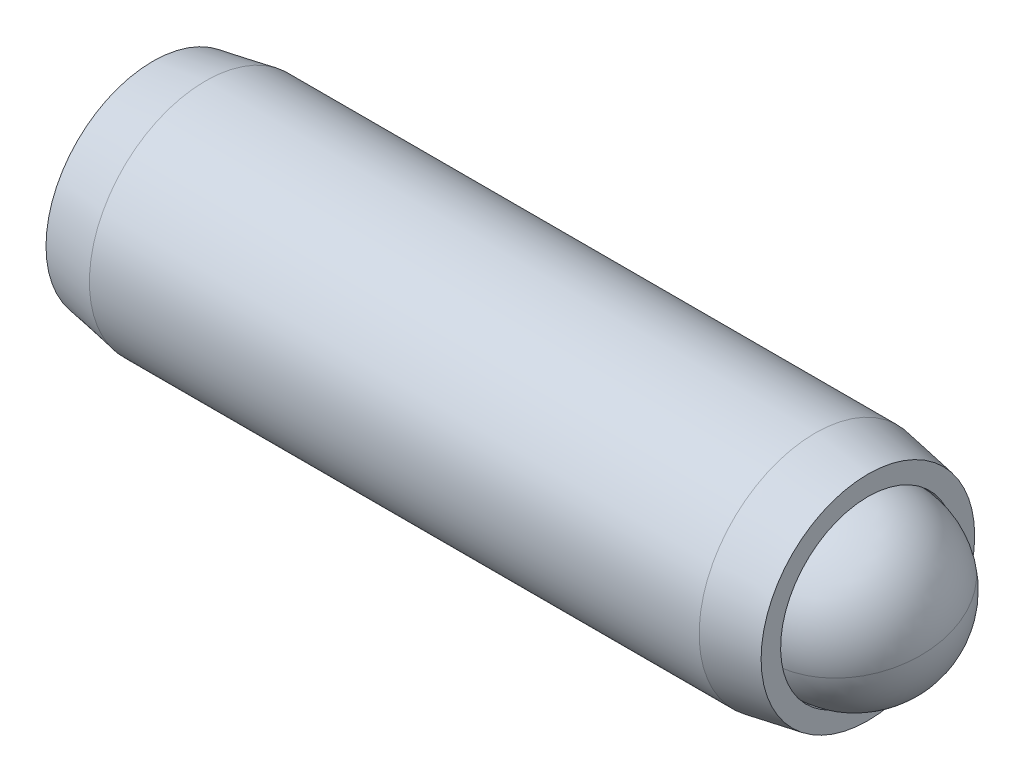
ISO-10303-21;
HEADER;
FILE_DESCRIPTION(('STEP AP214'),'2;1');
FILE_NAME('part.step','',(''),(''),'','','');
FILE_SCHEMA(('AUTOMOTIVE_DESIGN { 1 0 10303 214 1 1 1 1 }'));
ENDSEC;
DATA;
#1=APPLICATION_CONTEXT('core data for automotive mechanical design processes');
#2=APPLICATION_PROTOCOL_DEFINITION('international standard','automotive_design',2000,#1);
#3=PRODUCT_CONTEXT('',#1,'mechanical');
#4=PRODUCT('Part','Part','',(#3));
#5=PRODUCT_RELATED_PRODUCT_CATEGORY('part','',(#4));
#6=PRODUCT_DEFINITION_FORMATION('','',#4);
#7=PRODUCT_DEFINITION_CONTEXT('part definition',#1,'design');
#8=PRODUCT_DEFINITION('design','',#6,#7);
#9=PRODUCT_DEFINITION_SHAPE('','',#8);
#10=(LENGTH_UNIT() NAMED_UNIT(*) SI_UNIT(.MILLI.,.METRE.));
#11=(NAMED_UNIT(*) PLANE_ANGLE_UNIT() SI_UNIT($,.RADIAN.));
#12=(NAMED_UNIT(*) SI_UNIT($,.STERADIAN.) SOLID_ANGLE_UNIT());
#13=UNCERTAINTY_MEASURE_WITH_UNIT(LENGTH_MEASURE(1.E-05),#10,'distance_accuracy_value','');
#14=(GEOMETRIC_REPRESENTATION_CONTEXT(3) GLOBAL_UNCERTAINTY_ASSIGNED_CONTEXT((#13)) GLOBAL_UNIT_ASSIGNED_CONTEXT((#10,
#11,#12)) REPRESENTATION_CONTEXT('',''));
#15=CARTESIAN_POINT('',(0.,0.,0.));
#16=DIRECTION('',(0.,0.,1.));
#17=DIRECTION('',(1.,0.,0.));
#18=AXIS2_PLACEMENT_3D('',#15,#16,#17);
#19=CARTESIAN_POINT('',(-12.4963459470191,2.74204998828509,-0.965131231055238));
#20=DIRECTION('',(-1.,0.,0.));
#21=DIRECTION('',(0.,-1.,0.));
#22=AXIS2_PLACEMENT_3D('',#19,#20,#21);
#23=PLANE('',#22);
#24=DIRECTION('',(0.,0.866025403784439,-0.5));
#25=VECTOR('',#24,1.);
#26=CARTESIAN_POINT('',(-12.4963459470191,2.61504998828509,-2.33078112403965));
#27=LINE('',#26,#25);
#28=CARTESIAN_POINT('',(-12.4963459470191,1.49586248828509,-1.68461791964099));
#29=VERTEX_POINT('',#28);
#30=CARTESIAN_POINT('',(-12.4963459470191,2.74204998828509,-2.40410460822674));
#31=VERTEX_POINT('',#30);
#32=EDGE_CURVE('P0_E164',#29,#31,#27,.T.);
#33=ORIENTED_EDGE('',*,*,#32,.T.);
#34=DIRECTION('',(0.,0.866025403784439,0.5));
#35=VECTOR('',#34,1.);
#36=CARTESIAN_POINT('',(-12.4963459470191,3.86123748828509,-1.75794140382807));
#37=LINE('',#36,#35);
#38=CARTESIAN_POINT('',(-12.4963459470191,3.98823748828509,-1.68461791964099));
#39=VERTEX_POINT('',#38);
#40=EDGE_CURVE('P0_E166',#31,#39,#37,.T.);
#41=ORIENTED_EDGE('',*,*,#40,.T.);
#42=DIRECTION('',(0.,0.,1.));
#43=VECTOR('',#42,1.);
#44=CARTESIAN_POINT('',(-12.4963459470191,3.98823748828509,-0.392291510843657));
#45=LINE('',#44,#43);
#46=CARTESIAN_POINT('',(-12.4963459470191,3.98823748828509,-0.245644542469492));
#47=VERTEX_POINT('',#46);
#48=EDGE_CURVE('P0_E156',#39,#47,#45,.T.);
#49=ORIENTED_EDGE('',*,*,#48,.T.);
#50=DIRECTION('',(0.,-0.866025403784438,0.5));
#51=VECTOR('',#50,1.);
#52=CARTESIAN_POINT('',(-12.4963459470191,2.86904998828509,0.400518661929174));
#53=LINE('',#52,#51);
#54=CARTESIAN_POINT('',(-12.4963459470191,2.74204998828509,0.473842146116257));
#55=VERTEX_POINT('',#54);
#56=EDGE_CURVE('P0_E158',#47,#55,#53,.T.);
#57=ORIENTED_EDGE('',*,*,#56,.T.);
#58=DIRECTION('',(0.,-0.866025403784439,-0.5));
#59=VECTOR('',#58,1.);
#60=CARTESIAN_POINT('',(-12.4963459470191,1.62286248828509,-0.172321058282407));
#61=LINE('',#60,#59);
#62=CARTESIAN_POINT('',(-12.4963459470191,1.49586248828509,-0.24564454246949));
#63=VERTEX_POINT('',#62);
#64=EDGE_CURVE('P0_E160',#55,#63,#61,.T.);
#65=ORIENTED_EDGE('',*,*,#64,.T.);
#66=DIRECTION('',(0.,0.,-1.));
#67=VECTOR('',#66,1.);
#68=CARTESIAN_POINT('',(-12.4963459470191,1.49586248828509,-1.53797095126682));
#69=LINE('',#68,#67);
#70=EDGE_CURVE('P0_E162',#63,#29,#69,.T.);
#71=ORIENTED_EDGE('',*,*,#70,.T.);
#72=EDGE_LOOP('',(#33,#41,#49,#57,#65,#71));
#73=FACE_BOUND('',#72,.T.);
#74=CARTESIAN_POINT('',(-12.4963459470191,2.74204998828509,-0.965131231055238));
#75=DIRECTION('',(1.,0.,0.));
#76=DIRECTION('',(0.,1.,0.));
#77=AXIS2_PLACEMENT_3D('',#74,#75,#76);
#78=CIRCLE('',#77,2.921);
#79=CARTESIAN_POINT('',(-12.4963459470191,5.66304998828509,-0.965131231055238));
#80=VERTEX_POINT('',#79);
#81=EDGE_CURVE('P0_E150',#80,#80,#78,.T.);
#82=ORIENTED_EDGE('',*,*,#81,.F.);
#83=EDGE_LOOP('',(#82));
#84=FACE_BOUND('',#83,.T.);
#85=ADVANCED_FACE('P0_F17',(#73,#84),#23,.T.);
#86=CARTESIAN_POINT('',(-11.0558403648362,2.74204998828509,-0.965131231055238));
#87=DIRECTION('',(1.,0.,0.));
#88=DIRECTION('',(0.,1.,0.));
#89=AXIS2_PLACEMENT_3D('',#86,#87,#88);
#90=CONICAL_SURFACE('',#89,3.175,0.174532925199434);
#91=ORIENTED_EDGE('',*,*,#81,.T.);
#92=EDGE_LOOP('',(#91));
#93=FACE_BOUND('',#92,.T.);
#94=CARTESIAN_POINT('',(-11.0558403648362,2.74204998828509,-0.965131231055238));
#95=DIRECTION('',(1.,0.,0.));
#96=DIRECTION('',(0.,1.,0.));
#97=AXIS2_PLACEMENT_3D('',#94,#95,#96);
#98=CIRCLE('',#97,3.175);
#99=CARTESIAN_POINT('',(-11.0558403648362,5.91704998828509,-0.965131231055238));
#100=VERTEX_POINT('',#99);
#101=EDGE_CURVE('P0_E147',#100,#100,#98,.T.);
#102=ORIENTED_EDGE('',*,*,#101,.F.);
#103=EDGE_LOOP('',(#102));
#104=FACE_BOUND('',#103,.T.);
#105=ADVANCED_FACE('P0_F225',(#93,#104),#90,.T.);
#106=CARTESIAN_POINT('',(3.34480800757996,2.7420499882851,-0.965131231055238));
#107=DIRECTION('',(1.,0.,0.));
#108=DIRECTION('',(0.,1.,0.));
#109=AXIS2_PLACEMENT_3D('',#106,#107,#108);
#110=CYLINDRICAL_SURFACE('',#109,3.175);
#111=ORIENTED_EDGE('',*,*,#101,.T.);
#112=EDGE_LOOP('',(#111));
#113=FACE_BOUND('',#112,.T.);
#114=CARTESIAN_POINT('',(5.621148470798,2.7420499882851,-0.965131231055238));
#115=DIRECTION('',(1.,0.,0.));
#116=DIRECTION('',(0.,1.,0.));
#117=AXIS2_PLACEMENT_3D('',#114,#115,#116);
#118=CIRCLE('',#117,3.175);
#119=CARTESIAN_POINT('',(5.621148470798,5.91704998828509,-0.965131231055238));
#120=VERTEX_POINT('',#119);
#121=EDGE_CURVE('P0_E144',#120,#120,#118,.T.);
#122=ORIENTED_EDGE('',*,*,#121,.F.);
#123=EDGE_LOOP('',(#122));
#124=FACE_BOUND('',#123,.T.);
#125=ADVANCED_FACE('P0_F231',(#113,#124),#110,.T.);
#126=CARTESIAN_POINT('',(7.06165405298089,2.7420499882851,-0.965131231055238));
#127=DIRECTION('',(-1.,0.,0.));
#128=DIRECTION('',(0.,-1.,0.));
#129=AXIS2_PLACEMENT_3D('',#126,#127,#128);
#130=CONICAL_SURFACE('',#129,2.921,0.174532925199434);
#131=ORIENTED_EDGE('',*,*,#121,.T.);
#132=EDGE_LOOP('',(#131));
#133=FACE_BOUND('',#132,.T.);
#134=CARTESIAN_POINT('',(7.06165405298089,2.7420499882851,-0.965131231055238));
#135=DIRECTION('',(1.,0.,0.));
#136=DIRECTION('',(0.,1.,0.));
#137=AXIS2_PLACEMENT_3D('',#134,#135,#136);
#138=CIRCLE('',#137,2.921);
#139=CARTESIAN_POINT('',(7.06165405298089,5.66304998828509,-0.965131231055238));
#140=VERTEX_POINT('',#139);
#141=EDGE_CURVE('P0_E141',#140,#140,#138,.T.);
#142=ORIENTED_EDGE('',*,*,#141,.F.);
#143=EDGE_LOOP('',(#142));
#144=FACE_BOUND('',#143,.T.);
#145=ADVANCED_FACE('P0_F275',(#133,#144),#130,.T.);
#146=CARTESIAN_POINT('',(7.06165405298089,5.66304998828509,-0.965131231055238));
#147=DIRECTION('',(1.,0.,0.));
#148=DIRECTION('',(0.,1.,0.));
#149=AXIS2_PLACEMENT_3D('',#146,#147,#148);
#150=PLANE('',#149);
#151=ORIENTED_EDGE('',*,*,#141,.T.);
#152=EDGE_LOOP('',(#151));
#153=FACE_BOUND('',#152,.T.);
#154=CARTESIAN_POINT('',(7.06165405298089,2.7420499882851,-0.965131231055238));
#155=DIRECTION('',(1.,0.,0.));
#156=DIRECTION('',(0.,1.,0.));
#157=AXIS2_PLACEMENT_3D('',#154,#155,#156);
#158=CIRCLE('',#157,2.3876);
#159=CARTESIAN_POINT('',(7.06165405298089,5.1296499882851,-0.965131231055238));
#160=VERTEX_POINT('',#159);
#161=EDGE_CURVE('P0_E138',#160,#160,#158,.T.);
#162=ORIENTED_EDGE('',*,*,#161,.F.);
#163=EDGE_LOOP('',(#162));
#164=FACE_BOUND('',#163,.T.);
#165=ADVANCED_FACE('P0_F271',(#153,#164),#150,.T.);
#166=CARTESIAN_POINT('',(3.34480800757996,2.7420499882851,-0.965131231055238));
#167=DIRECTION('',(1.,0.,0.));
#168=DIRECTION('',(0.,1.,0.));
#169=AXIS2_PLACEMENT_3D('',#166,#167,#168);
#170=CYLINDRICAL_SURFACE('',#169,2.3876);
#171=ORIENTED_EDGE('',*,*,#161,.T.);
#172=EDGE_LOOP('',(#171));
#173=FACE_BOUND('',#172,.T.);
#174=CARTESIAN_POINT('',(5.73240800757996,2.7420499882851,-0.965131231055238));
#175=DIRECTION('',(1.,0.,0.));
#176=DIRECTION('',(0.,1.,0.));
#177=AXIS2_PLACEMENT_3D('',#174,#175,#176);
#178=CIRCLE('',#177,2.3876);
#179=CARTESIAN_POINT('',(5.73240800757995,5.1296499882851,-0.965131231055238));
#180=VERTEX_POINT('',#179);
#181=EDGE_CURVE('P0_E126',#180,#180,#178,.T.);
#182=ORIENTED_EDGE('',*,*,#181,.F.);
#183=EDGE_LOOP('',(#182));
#184=FACE_BOUND('',#183,.T.);
#185=ADVANCED_FACE('P0_F267',(#173,#184),#170,.F.);
#186=CARTESIAN_POINT('',(3.34480800757996,2.7420499882851,-0.965131231055238));
#187=DIRECTION('',(1.,0.,0.));
#188=DIRECTION('',(0.,1.,0.));
#189=AXIS2_PLACEMENT_3D('',#186,#187,#188);
#190=CONICAL_SURFACE('',#189,0.,0.78539816339745);
#191=ORIENTED_EDGE('',*,*,#181,.T.);
#192=EDGE_LOOP('',(#191));
#193=FACE_BOUND('',#192,.T.);
#194=CARTESIAN_POINT('',(3.34480800757996,2.7420499882851,-0.965131231055238));
#195=VERTEX_POINT('',#194);
#196=VERTEX_LOOP('',#195);
#197=FACE_BOUND('',#196,.T.);
#198=ADVANCED_FACE('P0_F221',(#193,#197),#190,.F.);
#199=CARTESIAN_POINT('',(-9.44834594701911,2.74204998828509,0.180548209367925));
#200=DIRECTION('',(0.,0.5,0.866025403784438));
#201=DIRECTION('',(0.,-0.866025403784438,0.5));
#202=AXIS2_PLACEMENT_3D('',#199,#200,#201);
#203=PLANE('',#202);
#204=DIRECTION('',(-1.,0.,0.));
#205=VECTOR('',#204,1.);
#206=CARTESIAN_POINT('',(-9.44834594701911,2.74204998828509,0.180548209367925));
#207=LINE('',#206,#205);
#208=CARTESIAN_POINT('',(-9.44834594701911,2.74204998828509,0.180548209367925));
#209=VERTEX_POINT('',#208);
#210=CARTESIAN_POINT('',(-12.2423459470191,2.74204998828509,0.180548209367925));
#211=VERTEX_POINT('',#210);
#212=EDGE_CURVE('P0_E124',#209,#211,#207,.T.);
#213=ORIENTED_EDGE('',*,*,#212,.T.);
#214=DIRECTION('',(0.,0.866025403784438,-0.5));
#215=VECTOR('',#214,1.);
#216=CARTESIAN_POINT('',(-12.2423459470191,3.73423748828509,-0.392291510843657));
#217=LINE('',#216,#215);
#218=CARTESIAN_POINT('',(-12.2423459470191,3.73423748828509,-0.392291510843657));
#219=VERTEX_POINT('',#218);
#220=EDGE_CURVE('P0_E26',#211,#219,#217,.T.);
#221=ORIENTED_EDGE('',*,*,#220,.T.);
#222=DIRECTION('',(-1.,0.,0.));
#223=VECTOR('',#222,1.);
#224=CARTESIAN_POINT('',(-9.44834594701911,3.73423748828509,-0.392291510843657));
#225=LINE('',#224,#223);
#226=CARTESIAN_POINT('',(-9.44834594701911,3.73423748828509,-0.392291510843657));
#227=VERTEX_POINT('',#226);
#228=EDGE_CURVE('P0_E90',#227,#219,#225,.T.);
#229=ORIENTED_EDGE('',*,*,#228,.F.);
#230=DIRECTION('',(0.,0.866025403784438,-0.5));
#231=VECTOR('',#230,1.);
#232=CARTESIAN_POINT('',(-9.44834594701911,2.74204998828509,0.180548209367925));
#233=LINE('',#232,#231);
#234=EDGE_CURVE('P0_E94',#209,#227,#233,.T.);
#235=ORIENTED_EDGE('',*,*,#234,.F.);
#236=EDGE_LOOP('',(#213,#221,#229,#235));
#237=FACE_BOUND('',#236,.T.);
#238=ADVANCED_FACE('P0_F92',(#237),#203,.F.);
#239=CARTESIAN_POINT('',(-9.44834594701911,1.74986248828509,-0.392291510843657));
#240=DIRECTION('',(0.,-0.499999999999999,0.866025403784439));
#241=DIRECTION('',(0.,-0.866025403784439,-0.5));
#242=AXIS2_PLACEMENT_3D('',#239,#240,#241);
#243=PLANE('',#242);
#244=DIRECTION('',(-1.,0.,0.));
#245=VECTOR('',#244,1.);
#246=CARTESIAN_POINT('',(-9.44834594701911,1.74986248828509,-0.392291510843657));
#247=LINE('',#246,#245);
#248=CARTESIAN_POINT('',(-9.44834594701911,1.74986248828509,-0.392291510843657));
#249=VERTEX_POINT('',#248);
#250=CARTESIAN_POINT('',(-12.2423459470191,1.74986248828509,-0.392291510843657));
#251=VERTEX_POINT('',#250);
#252=EDGE_CURVE('P0_E127',#249,#251,#247,.T.);
#253=ORIENTED_EDGE('',*,*,#252,.T.);
#254=DIRECTION('',(0.,0.866025403784439,0.5));
#255=VECTOR('',#254,1.);
#256=CARTESIAN_POINT('',(-12.2423459470191,2.74204998828509,0.180548209367925));
#257=LINE('',#256,#255);
#258=EDGE_CURVE('P0_E41',#251,#211,#257,.T.);
#259=ORIENTED_EDGE('',*,*,#258,.T.);
#260=ORIENTED_EDGE('',*,*,#212,.F.);
#261=DIRECTION('',(0.,0.866025403784439,0.5));
#262=VECTOR('',#261,1.);
#263=CARTESIAN_POINT('',(-9.44834594701911,1.74986248828509,-0.392291510843657));
#264=LINE('',#263,#262);
#265=EDGE_CURVE('P0_E99',#249,#209,#264,.T.);
#266=ORIENTED_EDGE('',*,*,#265,.F.);
#267=EDGE_LOOP('',(#253,#259,#260,#266));
#268=FACE_BOUND('',#267,.T.);
#269=ADVANCED_FACE('P0_F212',(#268),#243,.F.);
#270=CARTESIAN_POINT('',(-9.44834594701911,1.74986248828509,-1.53797095126682));
#271=DIRECTION('',(0.,-1.,0.));
#272=DIRECTION('',(0.,0.,-1.));
#273=AXIS2_PLACEMENT_3D('',#270,#271,#272);
#274=PLANE('',#273);
#275=DIRECTION('',(-1.,0.,0.));
#276=VECTOR('',#275,1.);
#277=CARTESIAN_POINT('',(-9.44834594701911,1.74986248828509,-1.53797095126682));
#278=LINE('',#277,#276);
#279=CARTESIAN_POINT('',(-9.44834594701911,1.74986248828509,-1.53797095126682));
#280=VERTEX_POINT('',#279);
#281=CARTESIAN_POINT('',(-12.2423459470191,1.74986248828509,-1.53797095126682));
#282=VERTEX_POINT('',#281);
#283=EDGE_CURVE('P0_E129',#280,#282,#278,.T.);
#284=ORIENTED_EDGE('',*,*,#283,.T.);
#285=DIRECTION('',(0.,0.,1.));
#286=VECTOR('',#285,1.);
#287=CARTESIAN_POINT('',(-12.2423459470191,1.74986248828509,-0.392291510843657));
#288=LINE('',#287,#286);
#289=EDGE_CURVE('P0_E171',#282,#251,#288,.T.);
#290=ORIENTED_EDGE('',*,*,#289,.T.);
#291=ORIENTED_EDGE('',*,*,#252,.F.);
#292=DIRECTION('',(0.,0.,1.));
#293=VECTOR('',#292,1.);
#294=CARTESIAN_POINT('',(-9.44834594701911,1.74986248828509,-1.53797095126682));
#295=LINE('',#294,#293);
#296=EDGE_CURVE('P0_E121',#280,#249,#295,.T.);
#297=ORIENTED_EDGE('',*,*,#296,.F.);
#298=EDGE_LOOP('',(#284,#290,#291,#297));
#299=FACE_BOUND('',#298,.T.);
#300=ADVANCED_FACE('P0_F211',(#299),#274,.F.);
#301=CARTESIAN_POINT('',(-9.44834594701911,2.74204998828509,-2.1108106714784));
#302=DIRECTION('',(0.,-0.5,-0.866025403784438));
#303=DIRECTION('',(0.,0.866025403784439,-0.5));
#304=AXIS2_PLACEMENT_3D('',#301,#302,#303);
#305=PLANE('',#304);
#306=DIRECTION('',(-1.,0.,0.));
#307=VECTOR('',#306,1.);
#308=CARTESIAN_POINT('',(-9.44834594701911,2.74204998828509,-2.1108106714784));
#309=LINE('',#308,#307);
#310=CARTESIAN_POINT('',(-9.44834594701911,2.74204998828509,-2.1108106714784));
#311=VERTEX_POINT('',#310);
#312=CARTESIAN_POINT('',(-12.2423459470191,2.74204998828509,-2.1108106714784));
#313=VERTEX_POINT('',#312);
#314=EDGE_CURVE('P0_E132',#311,#313,#309,.T.);
#315=ORIENTED_EDGE('',*,*,#314,.T.);
#316=DIRECTION('',(0.,-0.866025403784439,0.5));
#317=VECTOR('',#316,1.);
#318=CARTESIAN_POINT('',(-12.2423459470191,1.74986248828509,-1.53797095126682));
#319=LINE('',#318,#317);
#320=EDGE_CURVE('P0_E169',#313,#282,#319,.T.);
#321=ORIENTED_EDGE('',*,*,#320,.T.);
#322=ORIENTED_EDGE('',*,*,#283,.F.);
#323=DIRECTION('',(0.,-0.866025403784438,0.5));
#324=VECTOR('',#323,1.);
#325=CARTESIAN_POINT('',(-9.44834594701911,2.74204998828509,-2.1108106714784));
#326=LINE('',#325,#324);
#327=EDGE_CURVE('P0_E118',#311,#280,#326,.T.);
#328=ORIENTED_EDGE('',*,*,#327,.F.);
#329=EDGE_LOOP('',(#315,#321,#322,#328));
#330=FACE_BOUND('',#329,.T.);
#331=ADVANCED_FACE('P0_F208',(#330),#305,.F.);
#332=CARTESIAN_POINT('',(-9.44834594701911,3.73423748828509,-1.53797095126682));
#333=DIRECTION('',(0.,0.5,-0.866025403784439));
#334=DIRECTION('',(0.,0.866025403784439,0.5));
#335=AXIS2_PLACEMENT_3D('',#332,#333,#334);
#336=PLANE('',#335);
#337=DIRECTION('',(-1.,0.,0.));
#338=VECTOR('',#337,1.);
#339=CARTESIAN_POINT('',(-9.44834594701911,3.73423748828509,-1.53797095126682));
#340=LINE('',#339,#338);
#341=CARTESIAN_POINT('',(-9.44834594701911,3.73423748828509,-1.53797095126682));
#342=VERTEX_POINT('',#341);
#343=CARTESIAN_POINT('',(-12.2423459470191,3.73423748828509,-1.53797095126682));
#344=VERTEX_POINT('',#343);
#345=EDGE_CURVE('P0_E98',#342,#344,#340,.T.);
#346=ORIENTED_EDGE('',*,*,#345,.T.);
#347=DIRECTION('',(0.,-0.866025403784439,-0.5));
#348=VECTOR('',#347,1.);
#349=CARTESIAN_POINT('',(-12.2423459470191,2.74204998828509,-2.1108106714784));
#350=LINE('',#349,#348);
#351=EDGE_CURVE('P0_E153',#344,#313,#350,.T.);
#352=ORIENTED_EDGE('',*,*,#351,.T.);
#353=ORIENTED_EDGE('',*,*,#314,.F.);
#354=DIRECTION('',(0.,-0.866025403784439,-0.5));
#355=VECTOR('',#354,1.);
#356=CARTESIAN_POINT('',(-9.44834594701911,3.73423748828509,-1.53797095126682));
#357=LINE('',#356,#355);
#358=EDGE_CURVE('P0_E108',#342,#311,#357,.T.);
#359=ORIENTED_EDGE('',*,*,#358,.F.);
#360=EDGE_LOOP('',(#346,#352,#353,#359));
#361=FACE_BOUND('',#360,.T.);
#362=ADVANCED_FACE('P0_F204',(#361),#336,.F.);
#363=CARTESIAN_POINT('',(-9.44834594701911,3.73423748828509,-0.392291510843657));
#364=DIRECTION('',(0.,1.,0.));
#365=DIRECTION('',(-1.,0.,0.));
#366=AXIS2_PLACEMENT_3D('',#363,#364,#365);
#367=PLANE('',#366);
#368=ORIENTED_EDGE('',*,*,#228,.T.);
#369=DIRECTION('',(0.,0.,-1.));
#370=VECTOR('',#369,1.);
#371=CARTESIAN_POINT('',(-12.2423459470191,3.73423748828509,-1.53797095126682));
#372=LINE('',#371,#370);
#373=EDGE_CURVE('P0_E11',#219,#344,#372,.T.);
#374=ORIENTED_EDGE('',*,*,#373,.T.);
#375=ORIENTED_EDGE('',*,*,#345,.F.);
#376=DIRECTION('',(0.,0.,-1.));
#377=VECTOR('',#376,1.);
#378=CARTESIAN_POINT('',(-9.44834594701911,3.73423748828509,-0.392291510843657));
#379=LINE('',#378,#377);
#380=EDGE_CURVE('P0_E102',#227,#342,#379,.T.);
#381=ORIENTED_EDGE('',*,*,#380,.F.);
#382=EDGE_LOOP('',(#368,#374,#375,#381));
#383=FACE_BOUND('',#382,.T.);
#384=ADVANCED_FACE('P0_F103',(#383),#367,.F.);
#385=CARTESIAN_POINT('',(-9.44834594701911,4.72642498828509,-0.96513123105524));
#386=DIRECTION('',(-1.,0.,0.));
#387=DIRECTION('',(0.,0.,1.));
#388=AXIS2_PLACEMENT_3D('',#385,#386,#387);
#389=PLANE('',#388);
#390=ORIENTED_EDGE('',*,*,#234,.T.);
#391=ORIENTED_EDGE('',*,*,#380,.T.);
#392=ORIENTED_EDGE('',*,*,#358,.T.);
#393=ORIENTED_EDGE('',*,*,#327,.T.);
#394=ORIENTED_EDGE('',*,*,#296,.T.);
#395=ORIENTED_EDGE('',*,*,#265,.T.);
#396=EDGE_LOOP('',(#390,#391,#392,#393,#394,#395));
#397=FACE_BOUND('',#396,.T.);
#398=ADVANCED_FACE('P0_F110',(#397),#389,.T.);
#399=CARTESIAN_POINT('',(-12.2423459470191,1.74986248828509,-0.392291510843657));
#400=DIRECTION('',(-0.707106781186545,0.353553390593275,-0.612372435695797));
#401=DIRECTION('',(-0.65465367070798,0.,0.755928946018452));
#402=AXIS2_PLACEMENT_3D('',#399,#400,#401);
#403=PLANE('',#402);
#404=DIRECTION('',(-0.65465367070798,-0.654653670707975,0.377964473009227));
#405=VECTOR('',#404,1.);
#406=CARTESIAN_POINT('',(-11.958863804162,2.03334463114223,-0.55596000233268));
#407=LINE('',#406,#405);
#408=EDGE_CURVE('P0_E115',#63,#251,#407,.F.);
#409=ORIENTED_EDGE('',*,*,#408,.F.);
#410=ORIENTED_EDGE('',*,*,#64,.F.);
#411=DIRECTION('',(-0.65465367070798,0.,0.755928946018452));
#412=VECTOR('',#411,1.);
#413=CARTESIAN_POINT('',(-11.958863804162,2.74204998828509,-0.14678877361012));
#414=LINE('',#413,#412);
#415=EDGE_CURVE('P0_E21',#211,#55,#414,.T.);
#416=ORIENTED_EDGE('',*,*,#415,.F.);
#417=ORIENTED_EDGE('',*,*,#258,.F.);
#418=EDGE_LOOP('',(#409,#410,#416,#417));
#419=FACE_BOUND('',#418,.T.);
#420=ADVANCED_FACE('P0_F19',(#419),#403,.T.);
#421=CARTESIAN_POINT('',(-12.2423459470191,2.74204998828509,0.180548209367925));
#422=DIRECTION('',(-0.707106781186545,-0.353553390593276,-0.612372435695797));
#423=DIRECTION('',(-0.65465367070798,0.,0.755928946018452));
#424=AXIS2_PLACEMENT_3D('',#421,#422,#423);
#425=PLANE('',#424);
#426=ORIENTED_EDGE('',*,*,#415,.T.);
#427=ORIENTED_EDGE('',*,*,#56,.F.);
#428=DIRECTION('',(-0.65465367070798,0.654653670707975,0.377964473009225));
#429=VECTOR('',#428,1.);
#430=CARTESIAN_POINT('',(-11.958863804162,3.45075534542795,-0.55596000233268));
#431=LINE('',#430,#429);
#432=EDGE_CURVE('P0_E182',#219,#47,#431,.T.);
#433=ORIENTED_EDGE('',*,*,#432,.F.);
#434=ORIENTED_EDGE('',*,*,#220,.F.);
#435=EDGE_LOOP('',(#426,#427,#433,#434));
#436=FACE_BOUND('',#435,.T.);
#437=ADVANCED_FACE('P0_F196',(#436),#425,.T.);
#438=CARTESIAN_POINT('',(-12.2423459470191,1.74986248828509,-1.53797095126682));
#439=DIRECTION('',(-0.707106781186545,0.70710678118655,0.));
#440=DIRECTION('',(-0.70710678118655,-0.707106781186545,0.));
#441=AXIS2_PLACEMENT_3D('',#438,#439,#440);
#442=PLANE('',#441);
#443=ORIENTED_EDGE('',*,*,#408,.T.);
#444=ORIENTED_EDGE('',*,*,#289,.F.);
#445=DIRECTION('',(-0.65465367070798,-0.654653670707975,-0.377964473009226));
#446=VECTOR('',#445,1.);
#447=CARTESIAN_POINT('',(-11.958863804162,2.03334463114223,-1.3743024597778));
#448=LINE('',#447,#446);
#449=EDGE_CURVE('P0_E179',#29,#282,#448,.F.);
#450=ORIENTED_EDGE('',*,*,#449,.F.);
#451=ORIENTED_EDGE('',*,*,#70,.F.);
#452=EDGE_LOOP('',(#443,#444,#450,#451));
#453=FACE_BOUND('',#452,.T.);
#454=ADVANCED_FACE('P0_F189',(#453),#442,.T.);
#455=CARTESIAN_POINT('',(-12.2423459470191,3.73423748828509,-0.392291510843657));
#456=DIRECTION('',(-0.707106781186545,-0.70710678118655,0.));
#457=DIRECTION('',(0.70710678118655,-0.707106781186545,0.));
#458=AXIS2_PLACEMENT_3D('',#455,#456,#457);
#459=PLANE('',#458);
#460=ORIENTED_EDGE('',*,*,#432,.T.);
#461=ORIENTED_EDGE('',*,*,#48,.F.);
#462=DIRECTION('',(0.65465367070798,-0.654653670707975,0.377964473009226));
#463=VECTOR('',#462,1.);
#464=CARTESIAN_POINT('',(-12.2423459470191,3.73423748828509,-1.53797095126682));
#465=LINE('',#464,#463);
#466=EDGE_CURVE('P0_E177',#344,#39,#465,.F.);
#467=ORIENTED_EDGE('',*,*,#466,.F.);
#468=ORIENTED_EDGE('',*,*,#373,.F.);
#469=EDGE_LOOP('',(#460,#461,#467,#468));
#470=FACE_BOUND('',#469,.T.);
#471=ADVANCED_FACE('P0_F201',(#470),#459,.T.);
#472=CARTESIAN_POINT('',(-12.2423459470191,2.74204998828509,-2.1108106714784));
#473=DIRECTION('',(-0.707106781186545,0.353553390593275,0.612372435695797));
#474=DIRECTION('',(0.65465367070798,0.,0.755928946018452));
#475=AXIS2_PLACEMENT_3D('',#472,#473,#474);
#476=PLANE('',#475);
#477=ORIENTED_EDGE('',*,*,#449,.T.);
#478=ORIENTED_EDGE('',*,*,#320,.F.);
#479=DIRECTION('',(-0.65465367070798,0.,-0.755928946018452));
#480=VECTOR('',#479,1.);
#481=CARTESIAN_POINT('',(-11.958863804162,2.74204998828509,-1.78347368850036));
#482=LINE('',#481,#480);
#483=EDGE_CURVE('P0_E175',#31,#313,#482,.F.);
#484=ORIENTED_EDGE('',*,*,#483,.F.);
#485=ORIENTED_EDGE('',*,*,#32,.F.);
#486=EDGE_LOOP('',(#477,#478,#484,#485));
#487=FACE_BOUND('',#486,.T.);
#488=ADVANCED_FACE('P0_F240',(#487),#476,.T.);
#489=CARTESIAN_POINT('',(-12.2423459470191,3.73423748828509,-1.53797095126682));
#490=DIRECTION('',(-0.707106781186545,-0.353553390593275,0.612372435695797));
#491=DIRECTION('',(0.65465367070798,0.,0.755928946018452));
#492=AXIS2_PLACEMENT_3D('',#489,#490,#491);
#493=PLANE('',#492);
#494=ORIENTED_EDGE('',*,*,#466,.T.);
#495=ORIENTED_EDGE('',*,*,#40,.F.);
#496=ORIENTED_EDGE('',*,*,#483,.T.);
#497=ORIENTED_EDGE('',*,*,#351,.F.);
#498=EDGE_LOOP('',(#494,#495,#496,#497));
#499=FACE_BOUND('',#498,.T.);
#500=ADVANCED_FACE('P0_F237',(#499),#493,.T.);
#501=CLOSED_SHELL('',(#85,#105,#125,#145,#165,#185,#198,#238,#269,#300,#331,#362,#384,#398,#420,
#437,#454,#471,#488,#500));
#502=MANIFOLD_SOLID_BREP('P0_B1',#501);
#503=CARTESIAN_POINT('',(6.71240405298089,2.7420499882851,-0.965131231055239));
#504=DIRECTION('',(0.,0.972214232741158,0.234092899626454));
#505=DIRECTION('',(0.,0.234092899626454,-0.972214232741158));
#506=AXIS2_PLACEMENT_3D('',#503,#504,#505);
#507=SPHERICAL_SURFACE('',#506,2.38125);
#508=CARTESIAN_POINT('',(6.71240405298089,2.7420499882851,-0.965131231055239));
#509=DIRECTION('',(1.,0.,0.));
#510=DIRECTION('',(0.,0.234092899626454,-0.972214232741158));
#511=AXIS2_PLACEMENT_3D('',#508,#509,#510);
#512=CIRCLE('',#511,2.38125);
#513=CARTESIAN_POINT('',(6.71240405298089,3.29948370552059,-3.28021637277012));
#514=VERTEX_POINT('',#513);
#515=CARTESIAN_POINT('',(6.71240405298089,2.1846162710496,1.34995391065964));
#516=VERTEX_POINT('',#515);
#517=EDGE_CURVE('P1_E33',#514,#516,#512,.T.);
#518=ORIENTED_EDGE('',*,*,#517,.T.);
#519=CARTESIAN_POINT('',(6.71240405298089,2.7420499882851,-0.965131231055239));
#520=DIRECTION('',(0.,0.972214232741158,0.234092899626454));
#521=DIRECTION('',(1.,0.,0.));
#522=AXIS2_PLACEMENT_3D('',#519,#520,#521);
#523=CIRCLE('',#522,2.38125);
#524=EDGE_CURVE('P1_E10',#516,#514,#523,.T.);
#525=ORIENTED_EDGE('',*,*,#524,.T.);
#526=EDGE_LOOP('',(#518,#525));
#527=FACE_BOUND('',#526,.T.);
#528=ADVANCED_FACE('P1_F16',(#527),#507,.T.);
#529=ORIENTED_EDGE('',*,*,#517,.F.);
#530=CARTESIAN_POINT('',(6.71240405298089,2.7420499882851,-0.965131231055239));
#531=DIRECTION('',(0.,0.972214232741158,0.234092899626454));
#532=DIRECTION('',(1.,0.,0.));
#533=AXIS2_PLACEMENT_3D('',#530,#531,#532);
#534=CIRCLE('',#533,2.38125);
#535=EDGE_CURVE('P1_E23',#514,#516,#534,.T.);
#536=ORIENTED_EDGE('',*,*,#535,.T.);
#537=EDGE_LOOP('',(#529,#536));
#538=FACE_BOUND('',#537,.T.);
#539=ADVANCED_FACE('P1_F40',(#538),#507,.T.);
#540=ORIENTED_EDGE('',*,*,#524,.F.);
#541=EDGE_CURVE('P1_E36',#516,#514,#512,.T.);
#542=ORIENTED_EDGE('',*,*,#541,.T.);
#543=EDGE_LOOP('',(#540,#542));
#544=FACE_BOUND('',#543,.T.);
#545=ADVANCED_FACE('P1_F38',(#544),#507,.T.);
#546=ORIENTED_EDGE('',*,*,#535,.F.);
#547=ORIENTED_EDGE('',*,*,#541,.F.);
#548=EDGE_LOOP('',(#546,#547));
#549=FACE_BOUND('',#548,.T.);
#550=ADVANCED_FACE('P1_F18',(#549),#507,.T.);
#551=CLOSED_SHELL('',(#528,#539,#545,#550));
#552=MANIFOLD_SOLID_BREP('P1_B1',#551);
#553=ADVANCED_BREP_SHAPE_REPRESENTATION('',(#18,#502,#552),#14);
#554=SHAPE_DEFINITION_REPRESENTATION(#9,#553);
ENDSEC;
END-ISO-10303-21;
